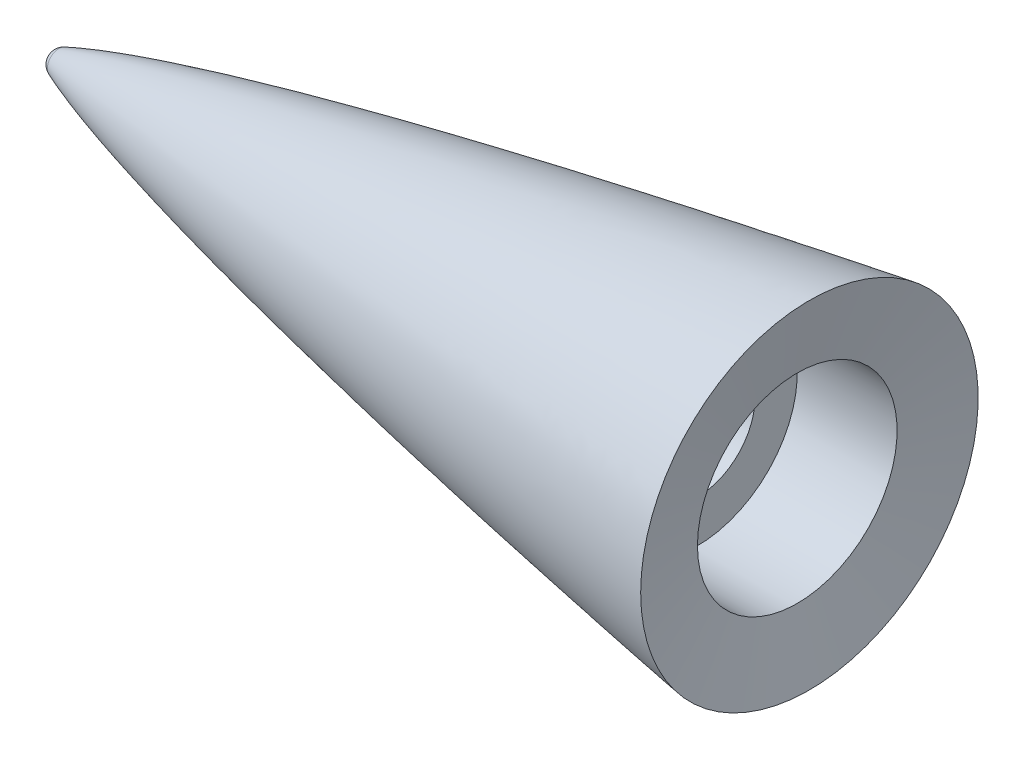
ISO-10303-21;
HEADER;
FILE_DESCRIPTION(('STEP AP214'),'2;1');
FILE_NAME('part.step','',(''),(''),'','','');
FILE_SCHEMA(('AUTOMOTIVE_DESIGN { 1 0 10303 214 1 1 1 1 }'));
ENDSEC;
DATA;
#1=APPLICATION_CONTEXT('core data for automotive mechanical design processes');
#2=APPLICATION_PROTOCOL_DEFINITION('international standard','automotive_design',2000,#1);
#3=PRODUCT_CONTEXT('',#1,'mechanical');
#4=PRODUCT('Part','Part','',(#3));
#5=PRODUCT_RELATED_PRODUCT_CATEGORY('part','',(#4));
#6=PRODUCT_DEFINITION_FORMATION('','',#4);
#7=PRODUCT_DEFINITION_CONTEXT('part definition',#1,'design');
#8=PRODUCT_DEFINITION('design','',#6,#7);
#9=PRODUCT_DEFINITION_SHAPE('','',#8);
#10=(LENGTH_UNIT() NAMED_UNIT(*) SI_UNIT(.MILLI.,.METRE.));
#11=(NAMED_UNIT(*) PLANE_ANGLE_UNIT() SI_UNIT($,.RADIAN.));
#12=(NAMED_UNIT(*) SI_UNIT($,.STERADIAN.) SOLID_ANGLE_UNIT());
#13=UNCERTAINTY_MEASURE_WITH_UNIT(LENGTH_MEASURE(1.E-05),#10,'distance_accuracy_value','');
#14=(GEOMETRIC_REPRESENTATION_CONTEXT(3) GLOBAL_UNCERTAINTY_ASSIGNED_CONTEXT((#13)) GLOBAL_UNIT_ASSIGNED_CONTEXT((#10,
#11,#12)) REPRESENTATION_CONTEXT('',''));
#15=CARTESIAN_POINT('',(0.,0.,0.));
#16=DIRECTION('',(0.,0.,1.));
#17=DIRECTION('',(1.,0.,0.));
#18=AXIS2_PLACEMENT_3D('',#15,#16,#17);
#19=CARTESIAN_POINT('',(0.,0.,0.));
#20=DIRECTION('',(-1.,0.,0.));
#21=DIRECTION('',(0.,0.,1.));
#22=AXIS2_PLACEMENT_3D('',#19,#20,#21);
#23=CYLINDRICAL_SURFACE('',#22,12.6999999999991);
#24=CARTESIAN_POINT('',(96.6194053925777,0.,0.));
#25=DIRECTION('',(-1.,0.,0.));
#26=DIRECTION('',(0.,0.,1.));
#27=AXIS2_PLACEMENT_3D('',#24,#25,#26);
#28=CIRCLE('',#27,12.6999999999991);
#29=CARTESIAN_POINT('',(96.6194053925777,0.,12.6999999999991));
#30=VERTEX_POINT('',#29);
#31=EDGE_CURVE('E42',#30,#30,#28,.T.);
#32=ORIENTED_EDGE('',*,*,#31,.F.);
#33=EDGE_LOOP('',(#32));
#34=FACE_BOUND('',#33,.T.);
#35=CARTESIAN_POINT('',(83.9194053925777,0.,0.));
#36=DIRECTION('',(-1.,0.,0.));
#37=DIRECTION('',(0.,0.,1.));
#38=AXIS2_PLACEMENT_3D('',#35,#36,#37);
#39=CIRCLE('',#38,12.6999999999991);
#40=CARTESIAN_POINT('',(83.9194053925777,0.,12.6999999999991));
#41=VERTEX_POINT('',#40);
#42=EDGE_CURVE('E11',#41,#41,#39,.T.);
#43=ORIENTED_EDGE('',*,*,#42,.T.);
#44=EDGE_LOOP('',(#43));
#45=FACE_BOUND('',#44,.T.);
#46=ADVANCED_FACE('F36',(#34,#45),#23,.F.);
#47=CARTESIAN_POINT('',(96.6194053925777,0.,0.));
#48=DIRECTION('',(1.,0.,0.));
#49=DIRECTION('',(0.,0.,-1.));
#50=AXIS2_PLACEMENT_3D('',#47,#48,#49);
#51=CONICAL_SURFACE('',#50,12.6999999999991,1.39626340127345);
#52=CARTESIAN_POINT('',(98.1654285822372,0.,0.));
#53=DIRECTION('',(-1.,0.,0.));
#54=DIRECTION('',(0.,0.,1.));
#55=AXIS2_PLACEMENT_3D('',#52,#53,#54);
#56=CIRCLE('',#55,21.4679331917127);
#57=CARTESIAN_POINT('',(98.1654285822372,0.,21.4679331917127));
#58=VERTEX_POINT('',#57);
#59=EDGE_CURVE('E59',#58,#58,#56,.T.);
#60=ORIENTED_EDGE('',*,*,#59,.F.);
#61=EDGE_LOOP('',(#60));
#62=FACE_BOUND('',#61,.T.);
#63=ORIENTED_EDGE('',*,*,#31,.T.);
#64=EDGE_LOOP('',(#63));
#65=FACE_BOUND('',#64,.T.);
#66=ADVANCED_FACE('F76',(#62,#65),#51,.F.);
#67=CARTESIAN_POINT('',(98.1654285822372,0.,-21.4679331917127));
#68=CARTESIAN_POINT('',(98.1649634916526,0.,-21.4678588449243));
#69=CARTESIAN_POINT('',(97.3333723487103,0.,-21.3349250189469));
#70=CARTESIAN_POINT('',(95.6643282605513,0.,-21.0670430360893));
#71=CARTESIAN_POINT('',(92.4583875897154,0.,-20.5496454295419));
#72=CARTESIAN_POINT('',(89.1687402481209,0.,-20.01035749334));
#73=CARTESIAN_POINT('',(85.3070651026785,0.,-19.3724410882181));
#74=CARTESIAN_POINT('',(81.7849613772071,0.,-18.7812835294238));
#75=CARTESIAN_POINT('',(78.0654253465569,0.,-18.1506618123487));
#76=CARTESIAN_POINT('',(74.4590688039419,0.,-17.529825957153));
#77=CARTESIAN_POINT('',(69.8838967805536,0.,-16.7320623592298));
#78=CARTESIAN_POINT('',(64.433980883078,0.,-15.762645369331));
#79=CARTESIAN_POINT('',(58.0581539205274,0.,-14.599266319204));
#80=CARTESIAN_POINT('',(50.7937769881176,0.,-13.2269844957505));
#81=CARTESIAN_POINT('',(43.5319010479667,0.,-11.8011118443972));
#82=CARTESIAN_POINT('',(36.2869207738544,0.,-10.3137447182511));
#83=CARTESIAN_POINT('',(29.0553638889182,0.,-8.74917784058436));
#84=CARTESIAN_POINT('',(21.8473172630035,0.,-7.08667894424691));
#85=CARTESIAN_POINT('',(15.352608070185,0.,-5.45893404606891));
#86=CARTESIAN_POINT('',(9.95928520495974,0.,-3.96140285403248));
#87=CARTESIAN_POINT('',(6.075542743369,0.,-2.73558534633651));
#88=CARTESIAN_POINT('',(3.98276576439607,0.,-1.98697691340815));
#89=CARTESIAN_POINT('',(2.98209212708906,0.,-1.59174228338426));
#90=CARTESIAN_POINT('',(2.68212714829333,0.,-1.46864436178185));
#91=B_SPLINE_CURVE_WITH_KNOTS('',4,(#67,#68,#69,#70,#71,#72,#73,#74,#75,#76,#77,#78,#79,#80,#81,
#82,#83,#84,#85,#86,#87,#88,#89,#90),.UNSPECIFIED.,.F.,.F.,(5,1,1,1,1,1,1,1,1,1,1,1,1,1,1,1,1,1,
1,1,5),(0.0278472915357822,0.027865992606384,0.0612851050743567,0.0947042175423293,
0.128123330739517,0.161542443936705,0.19496155644882,0.228380668960934,0.261799782410048,
0.295218895859162,0.362057120379876,0.428895345791834,0.495733571812303,0.562571797598629,
0.629410022065666,0.696248245184353,0.763086473220951,0.829924693269756,0.871354334932588,
0.898515123136172,0.910233153347234),.UNSPECIFIED.);
#92=CARTESIAN_POINT('',(0.,0.,0.));
#93=DIRECTION('',(-1.,0.,0.));
#94=AXIS1_PLACEMENT('',#92,#93);
#95=SURFACE_OF_REVOLUTION('',#91,#94);
#96=CARTESIAN_POINT('',(2.68212714828047,0.,0.));
#97=DIRECTION('',(-1.,0.,0.));
#98=DIRECTION('',(0.,0.,1.));
#99=AXIS2_PLACEMENT_3D('',#96,#97,#98);
#100=CIRCLE('',#99,1.46864436177657);
#101=CARTESIAN_POINT('',(2.68212714828047,0.,1.46864436177657));
#102=VERTEX_POINT('',#101);
#103=EDGE_CURVE('E55',#102,#102,#100,.T.);
#104=ORIENTED_EDGE('',*,*,#103,.F.);
#105=EDGE_LOOP('',(#104));
#106=FACE_BOUND('',#105,.T.);
#107=ORIENTED_EDGE('',*,*,#59,.T.);
#108=EDGE_LOOP('',(#107));
#109=FACE_BOUND('',#108,.T.);
#110=ADVANCED_FACE('F72',(#106,#109),#95,.T.);
#111=CARTESIAN_POINT('',(3.28482109112484,0.,-4.06476068082195E-11));
#112=DIRECTION('',(-1.,0.,0.));
#113=DIRECTION('',(0.,0.,-1.));
#114=AXIS2_PLACEMENT_3D('',#111,#112,#113);
#115=SPHERICAL_SURFACE('',#114,1.5875);
#116=ORIENTED_EDGE('',*,*,#103,.T.);
#117=EDGE_LOOP('',(#116));
#118=FACE_BOUND('',#117,.T.);
#119=ADVANCED_FACE('F75',(#118),#115,.T.);
#120=CARTESIAN_POINT('',(83.9194053925777,0.,-7.68858));
#121=DIRECTION('',(-1.,0.,0.));
#122=DIRECTION('',(0.,0.,1.));
#123=AXIS2_PLACEMENT_3D('',#120,#121,#122);
#124=PLANE('',#123);
#125=CARTESIAN_POINT('',(83.9194053925777,0.,0.));
#126=DIRECTION('',(1.,0.,0.));
#127=DIRECTION('',(0.,0.,-1.));
#128=AXIS2_PLACEMENT_3D('',#125,#126,#127);
#129=CIRCLE('',#128,7.34186999999999);
#130=CARTESIAN_POINT('',(83.9194053925777,0.,-7.34186999999999));
#131=VERTEX_POINT('',#130);
#132=EDGE_CURVE('E56',#131,#131,#129,.T.);
#133=ORIENTED_EDGE('',*,*,#132,.F.);
#134=EDGE_LOOP('',(#133));
#135=FACE_BOUND('',#134,.T.);
#136=ORIENTED_EDGE('',*,*,#42,.F.);
#137=EDGE_LOOP('',(#136));
#138=FACE_BOUND('',#137,.T.);
#139=ADVANCED_FACE('F49',(#135,#138),#124,.F.);
#140=CARTESIAN_POINT('',(55.9794053925777,0.,0.));
#141=DIRECTION('',(1.,0.,0.));
#142=DIRECTION('',(0.,0.,-1.));
#143=AXIS2_PLACEMENT_3D('',#140,#141,#142);
#144=CONICAL_SURFACE('',#143,7.34186999999999,1.02974425867665);
#145=CARTESIAN_POINT('',(51.5679648395578,0.,0.));
#146=VERTEX_POINT('',#145);
#147=VERTEX_LOOP('',#146);
#148=FACE_BOUND('',#147,.T.);
#149=CARTESIAN_POINT('',(55.9794053925777,0.,0.));
#150=DIRECTION('',(1.,0.,0.));
#151=DIRECTION('',(0.,0.,-1.));
#152=AXIS2_PLACEMENT_3D('',#149,#150,#151);
#153=CIRCLE('',#152,7.34186999999999);
#154=CARTESIAN_POINT('',(55.9794053925777,0.,-7.34186999999999));
#155=VERTEX_POINT('',#154);
#156=EDGE_CURVE('E53',#155,#155,#153,.T.);
#157=ORIENTED_EDGE('',*,*,#156,.T.);
#158=EDGE_LOOP('',(#157));
#159=FACE_BOUND('',#158,.T.);
#160=ADVANCED_FACE('F45',(#148,#159),#144,.F.);
#161=CARTESIAN_POINT('',(83.9194053925777,0.,0.));
#162=DIRECTION('',(1.,0.,0.));
#163=DIRECTION('',(0.,0.,-1.));
#164=AXIS2_PLACEMENT_3D('',#161,#162,#163);
#165=CYLINDRICAL_SURFACE('',#164,7.34186999999999);
#166=ORIENTED_EDGE('',*,*,#156,.F.);
#167=EDGE_LOOP('',(#166));
#168=FACE_BOUND('',#167,.T.);
#169=ORIENTED_EDGE('',*,*,#132,.T.);
#170=EDGE_LOOP('',(#169));
#171=FACE_BOUND('',#170,.T.);
#172=ADVANCED_FACE('F48',(#168,#171),#165,.F.);
#173=CLOSED_SHELL('',(#46,#66,#110,#119,#139,#160,#172));
#174=MANIFOLD_SOLID_BREP('B2',#173);
#175=ADVANCED_BREP_SHAPE_REPRESENTATION('',(#18,#174),#14);
#176=SHAPE_DEFINITION_REPRESENTATION(#9,#175);
ENDSEC;
END-ISO-10303-21;
